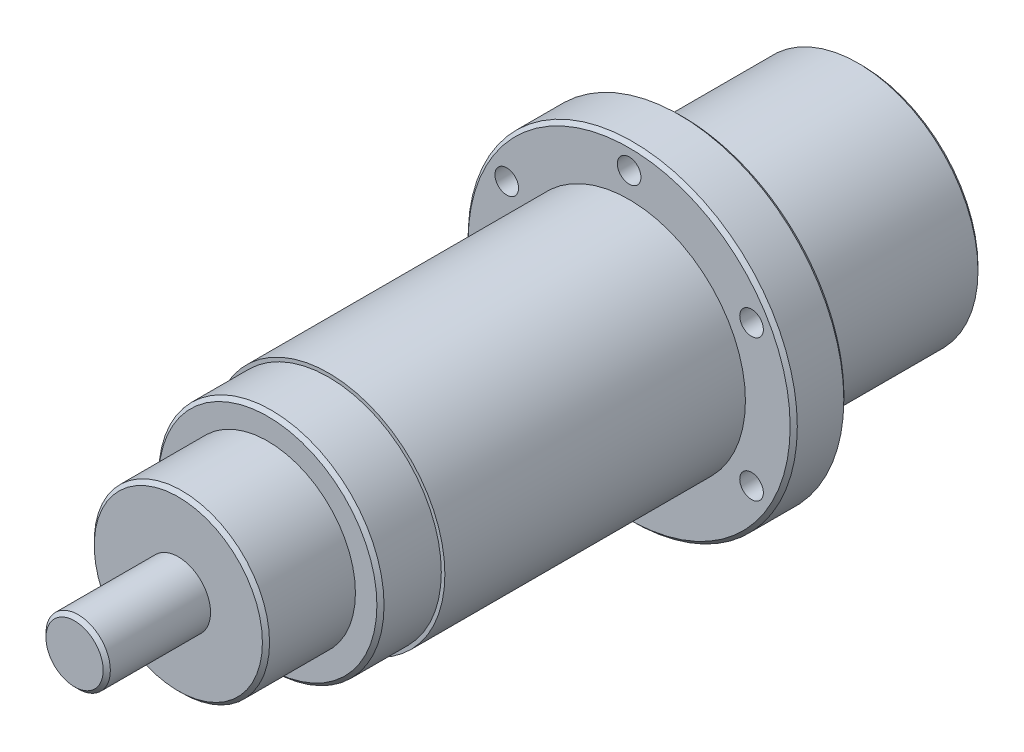
ISO-10303-21;
HEADER;
FILE_DESCRIPTION(('STEP AP214'),'2;1');
FILE_NAME('part.step','',(''),(''),'','','');
FILE_SCHEMA(('AUTOMOTIVE_DESIGN { 1 0 10303 214 1 1 1 1 }'));
ENDSEC;
DATA;
#1=APPLICATION_CONTEXT('core data for automotive mechanical design processes');
#2=APPLICATION_PROTOCOL_DEFINITION('international standard','automotive_design',2000,#1);
#3=PRODUCT_CONTEXT('',#1,'mechanical');
#4=PRODUCT('Part','Part','',(#3));
#5=PRODUCT_RELATED_PRODUCT_CATEGORY('part','',(#4));
#6=PRODUCT_DEFINITION_FORMATION('','',#4);
#7=PRODUCT_DEFINITION_CONTEXT('part definition',#1,'design');
#8=PRODUCT_DEFINITION('design','',#6,#7);
#9=PRODUCT_DEFINITION_SHAPE('','',#8);
#10=(LENGTH_UNIT() NAMED_UNIT(*) SI_UNIT(.MILLI.,.METRE.));
#11=(NAMED_UNIT(*) PLANE_ANGLE_UNIT() SI_UNIT($,.RADIAN.));
#12=(NAMED_UNIT(*) SI_UNIT($,.STERADIAN.) SOLID_ANGLE_UNIT());
#13=UNCERTAINTY_MEASURE_WITH_UNIT(LENGTH_MEASURE(1.E-05),#10,'distance_accuracy_value','');
#14=(GEOMETRIC_REPRESENTATION_CONTEXT(3) GLOBAL_UNCERTAINTY_ASSIGNED_CONTEXT((#13)) GLOBAL_UNIT_ASSIGNED_CONTEXT((#10,
#11,#12)) REPRESENTATION_CONTEXT('',''));
#15=CARTESIAN_POINT('',(0.,0.,0.));
#16=DIRECTION('',(0.,0.,1.));
#17=DIRECTION('',(1.,0.,0.));
#18=AXIS2_PLACEMENT_3D('',#15,#16,#17);
#19=CARTESIAN_POINT('',(0.,0.,50.));
#20=DIRECTION('',(0.,0.,-1.));
#21=DIRECTION('',(-1.,0.,0.));
#22=AXIS2_PLACEMENT_3D('',#19,#20,#21);
#23=CYLINDRICAL_SURFACE('',#22,33.5);
#24=CARTESIAN_POINT('',(0.,0.,1.00000000000002));
#25=DIRECTION('',(0.,0.,1.));
#26=DIRECTION('',(1.,0.,0.));
#27=AXIS2_PLACEMENT_3D('',#24,#25,#26);
#28=CIRCLE('',#27,33.5);
#29=CARTESIAN_POINT('',(33.5,0.,1.00000000000002));
#30=VERTEX_POINT('',#29);
#31=EDGE_CURVE('E47',#30,#30,#28,.T.);
#32=ORIENTED_EDGE('',*,*,#31,.T.);
#33=EDGE_LOOP('',(#32));
#34=FACE_BOUND('',#33,.T.);
#35=CARTESIAN_POINT('',(0.,0.,50.));
#36=DIRECTION('',(0.,0.,1.));
#37=DIRECTION('',(1.,0.,0.));
#38=AXIS2_PLACEMENT_3D('',#35,#36,#37);
#39=CIRCLE('',#38,33.5);
#40=CARTESIAN_POINT('',(33.5,0.,50.));
#41=VERTEX_POINT('',#40);
#42=EDGE_CURVE('E108',#41,#41,#39,.T.);
#43=ORIENTED_EDGE('',*,*,#42,.F.);
#44=EDGE_LOOP('',(#43));
#45=FACE_BOUND('',#44,.T.);
#46=ADVANCED_FACE('F37',(#34,#45),#23,.T.);
#47=CARTESIAN_POINT('',(0.,0.,0.));
#48=DIRECTION('',(0.,0.,1.));
#49=DIRECTION('',(1.,0.,0.));
#50=AXIS2_PLACEMENT_3D('',#47,#48,#49);
#51=PLANE('',#50);
#52=CARTESIAN_POINT('',(0.,0.,0.));
#53=DIRECTION('',(0.,0.,1.));
#54=DIRECTION('',(1.,0.,0.));
#55=AXIS2_PLACEMENT_3D('',#52,#53,#54);
#56=CIRCLE('',#55,32.5);
#57=CARTESIAN_POINT('',(32.5,0.,0.));
#58=VERTEX_POINT('',#57);
#59=EDGE_CURVE('E11',#58,#58,#56,.F.);
#60=ORIENTED_EDGE('',*,*,#59,.T.);
#61=EDGE_LOOP('',(#60));
#62=FACE_BOUND('',#61,.T.);
#63=CARTESIAN_POINT('',(0.,0.,0.));
#64=DIRECTION('',(0.,0.,-1.));
#65=DIRECTION('',(-1.,0.,0.));
#66=AXIS2_PLACEMENT_3D('',#63,#64,#65);
#67=CIRCLE('',#66,15.);
#68=CARTESIAN_POINT('',(-15.,0.,0.));
#69=VERTEX_POINT('',#68);
#70=EDGE_CURVE('E91',#69,#69,#67,.T.);
#71=ORIENTED_EDGE('',*,*,#70,.F.);
#72=EDGE_LOOP('',(#71));
#73=FACE_BOUND('',#72,.T.);
#74=ADVANCED_FACE('F243',(#62,#73),#51,.F.);
#75=CARTESIAN_POINT('',(0.,0.,65.));
#76=DIRECTION('',(0.,0.,-1.));
#77=DIRECTION('',(-1.,0.,0.));
#78=AXIS2_PLACEMENT_3D('',#75,#76,#77);
#79=CYLINDRICAL_SURFACE('',#78,46.);
#80=CARTESIAN_POINT('',(0.,0.,64.));
#81=DIRECTION('',(0.,0.,1.));
#82=DIRECTION('',(1.,0.,0.));
#83=AXIS2_PLACEMENT_3D('',#80,#81,#82);
#84=CIRCLE('',#83,46.);
#85=CARTESIAN_POINT('',(46.,0.,64.));
#86=VERTEX_POINT('',#85);
#87=EDGE_CURVE('E136',#86,#86,#84,.F.);
#88=ORIENTED_EDGE('',*,*,#87,.T.);
#89=EDGE_LOOP('',(#88));
#90=FACE_BOUND('',#89,.T.);
#91=CARTESIAN_POINT('',(0.,0.,51.));
#92=DIRECTION('',(0.,0.,1.));
#93=DIRECTION('',(1.,0.,0.));
#94=AXIS2_PLACEMENT_3D('',#91,#92,#93);
#95=CIRCLE('',#94,46.);
#96=CARTESIAN_POINT('',(46.,0.,51.));
#97=VERTEX_POINT('',#96);
#98=EDGE_CURVE('E133',#97,#97,#95,.T.);
#99=ORIENTED_EDGE('',*,*,#98,.T.);
#100=EDGE_LOOP('',(#99));
#101=FACE_BOUND('',#100,.T.);
#102=ADVANCED_FACE('F249',(#90,#101),#79,.T.);
#103=CARTESIAN_POINT('',(0.,0.,65.));
#104=DIRECTION('',(0.,0.,1.));
#105=DIRECTION('',(1.,0.,0.));
#106=AXIS2_PLACEMENT_3D('',#103,#104,#105);
#107=PLANE('',#106);
#108=CARTESIAN_POINT('',(0.,39.5,65.));
#109=DIRECTION('',(0.,0.,1.));
#110=DIRECTION('',(1.,0.,0.));
#111=AXIS2_PLACEMENT_3D('',#108,#109,#110);
#112=CIRCLE('',#111,3.3);
#113=CARTESIAN_POINT('',(3.3,39.5,65.));
#114=VERTEX_POINT('',#113);
#115=EDGE_CURVE('E42',#114,#114,#112,.T.);
#116=ORIENTED_EDGE('',*,*,#115,.F.);
#117=EDGE_LOOP('',(#116));
#118=FACE_BOUND('',#117,.T.);
#119=CARTESIAN_POINT('',(34.2080034494845,19.7499999999985,65.));
#120=DIRECTION('',(0.,0.,1.));
#121=DIRECTION('',(1.,0.,0.));
#122=AXIS2_PLACEMENT_3D('',#119,#120,#121);
#123=CIRCLE('',#122,3.3000000000017);
#124=CARTESIAN_POINT('',(37.5080034494862,19.7499999999985,65.));
#125=VERTEX_POINT('',#124);
#126=EDGE_CURVE('E157',#125,#125,#123,.T.);
#127=ORIENTED_EDGE('',*,*,#126,.F.);
#128=EDGE_LOOP('',(#127));
#129=FACE_BOUND('',#128,.T.);
#130=CARTESIAN_POINT('',(34.2080034494828,-19.7500000000015,65.));
#131=DIRECTION('',(0.,0.,1.));
#132=DIRECTION('',(1.,0.,0.));
#133=AXIS2_PLACEMENT_3D('',#130,#131,#132);
#134=CIRCLE('',#133,3.30000000000321);
#135=CARTESIAN_POINT('',(37.508003449486,-19.7500000000015,65.));
#136=VERTEX_POINT('',#135);
#137=EDGE_CURVE('E155',#136,#136,#134,.T.);
#138=ORIENTED_EDGE('',*,*,#137,.F.);
#139=EDGE_LOOP('',(#138));
#140=FACE_BOUND('',#139,.T.);
#141=CARTESIAN_POINT('',(-3.35346050293298E-12,-39.5,65.));
#142=DIRECTION('',(0.,0.,1.));
#143=DIRECTION('',(1.,0.,0.));
#144=AXIS2_PLACEMENT_3D('',#141,#142,#143);
#145=CIRCLE('',#144,3.30000000000347);
#146=CARTESIAN_POINT('',(3.30000000000012,-39.5,65.));
#147=VERTEX_POINT('',#146);
#148=EDGE_CURVE('E152',#147,#147,#145,.T.);
#149=ORIENTED_EDGE('',*,*,#148,.F.);
#150=EDGE_LOOP('',(#149));
#151=FACE_BOUND('',#150,.T.);
#152=CARTESIAN_POINT('',(-34.2080034494878,-19.7499999999985,65.));
#153=DIRECTION('',(0.,0.,1.));
#154=DIRECTION('',(1.,0.,0.));
#155=AXIS2_PLACEMENT_3D('',#152,#153,#154);
#156=CIRCLE('',#155,3.30000000000217);
#157=CARTESIAN_POINT('',(-30.9080034494857,-19.7499999999985,65.));
#158=VERTEX_POINT('',#157);
#159=EDGE_CURVE('E148',#158,#158,#156,.T.);
#160=ORIENTED_EDGE('',*,*,#159,.F.);
#161=EDGE_LOOP('',(#160));
#162=FACE_BOUND('',#161,.T.);
#163=CARTESIAN_POINT('',(-34.2080034494862,19.7500000000015,65.));
#164=DIRECTION('',(0.,0.,1.));
#165=DIRECTION('',(1.,0.,0.));
#166=AXIS2_PLACEMENT_3D('',#163,#164,#165);
#167=CIRCLE('',#166,3.30000000000048);
#168=CARTESIAN_POINT('',(-30.9080034494857,19.7500000000015,65.));
#169=VERTEX_POINT('',#168);
#170=EDGE_CURVE('E145',#169,#169,#167,.T.);
#171=ORIENTED_EDGE('',*,*,#170,.F.);
#172=EDGE_LOOP('',(#171));
#173=FACE_BOUND('',#172,.T.);
#174=CARTESIAN_POINT('',(0.,0.,65.));
#175=DIRECTION('',(0.,0.,1.));
#176=DIRECTION('',(1.,0.,0.));
#177=AXIS2_PLACEMENT_3D('',#174,#175,#176);
#178=CIRCLE('',#177,45.);
#179=CARTESIAN_POINT('',(45.,0.,65.));
#180=VERTEX_POINT('',#179);
#181=EDGE_CURVE('E130',#180,#180,#178,.T.);
#182=ORIENTED_EDGE('',*,*,#181,.T.);
#183=EDGE_LOOP('',(#182));
#184=FACE_BOUND('',#183,.T.);
#185=CARTESIAN_POINT('',(0.,0.,65.));
#186=DIRECTION('',(0.,0.,1.));
#187=DIRECTION('',(1.,0.,0.));
#188=AXIS2_PLACEMENT_3D('',#185,#186,#187);
#189=CIRCLE('',#188,32.5);
#190=CARTESIAN_POINT('',(32.5,0.,65.));
#191=VERTEX_POINT('',#190);
#192=EDGE_CURVE('E105',#191,#191,#189,.T.);
#193=ORIENTED_EDGE('',*,*,#192,.F.);
#194=EDGE_LOOP('',(#193));
#195=FACE_BOUND('',#194,.T.);
#196=ADVANCED_FACE('F348',(#118,#129,#140,#151,#162,#173,#184,#195),#107,.T.);
#197=CARTESIAN_POINT('',(0.,0.,50.));
#198=DIRECTION('',(0.,0.,1.));
#199=DIRECTION('',(1.,0.,0.));
#200=AXIS2_PLACEMENT_3D('',#197,#198,#199);
#201=PLANE('',#200);
#202=CARTESIAN_POINT('',(0.,0.,50.));
#203=DIRECTION('',(0.,0.,1.));
#204=DIRECTION('',(1.,0.,0.));
#205=AXIS2_PLACEMENT_3D('',#202,#203,#204);
#206=CIRCLE('',#205,45.);
#207=CARTESIAN_POINT('',(-38.9711431702992,22.5000000000008,50.));
#208=VERTEX_POINT('',#207);
#209=CARTESIAN_POINT('',(0.,45.,50.));
#210=VERTEX_POINT('',#209);
#211=EDGE_CURVE('E197',#208,#210,#206,.F.);
#212=ORIENTED_EDGE('',*,*,#211,.T.);
#213=CARTESIAN_POINT('',(0.,39.5,50.));
#214=DIRECTION('',(0.,0.,-1.));
#215=DIRECTION('',(-1.,0.,0.));
#216=AXIS2_PLACEMENT_3D('',#213,#214,#215);
#217=CIRCLE('',#216,5.5);
#218=EDGE_CURVE('E58',#210,#210,#217,.T.);
#219=ORIENTED_EDGE('',*,*,#218,.F.);
#220=CARTESIAN_POINT('',(38.9711431703002,22.4999999999991,50.));
#221=VERTEX_POINT('',#220);
#222=EDGE_CURVE('E199',#210,#221,#206,.F.);
#223=ORIENTED_EDGE('',*,*,#222,.T.);
#224=CARTESIAN_POINT('',(34.2080034494845,19.7499999999985,50.));
#225=DIRECTION('',(0.,0.,-1.));
#226=DIRECTION('',(-1.,0.,0.));
#227=AXIS2_PLACEMENT_3D('',#224,#225,#226);
#228=CIRCLE('',#227,5.50000000000169);
#229=EDGE_CURVE('E53',#221,#221,#228,.T.);
#230=ORIENTED_EDGE('',*,*,#229,.F.);
#231=CARTESIAN_POINT('',(38.9711431702983,-22.5000000000025,50.));
#232=VERTEX_POINT('',#231);
#233=EDGE_CURVE('E139',#221,#232,#206,.F.);
#234=ORIENTED_EDGE('',*,*,#233,.T.);
#235=CARTESIAN_POINT('',(34.2080034494828,-19.7500000000015,50.));
#236=DIRECTION('',(0.,0.,-1.));
#237=DIRECTION('',(-1.,0.,0.));
#238=AXIS2_PLACEMENT_3D('',#235,#236,#237);
#239=CIRCLE('',#238,5.50000000000321);
#240=EDGE_CURVE('E72',#232,#232,#239,.T.);
#241=ORIENTED_EDGE('',*,*,#240,.F.);
#242=CARTESIAN_POINT('',(-3.82039804131605E-12,-45.,50.));
#243=VERTEX_POINT('',#242);
#244=EDGE_CURVE('E140',#232,#243,#206,.F.);
#245=ORIENTED_EDGE('',*,*,#244,.T.);
#246=CARTESIAN_POINT('',(-3.35346050293298E-12,-39.5,50.));
#247=DIRECTION('',(0.,0.,-1.));
#248=DIRECTION('',(-1.,0.,0.));
#249=AXIS2_PLACEMENT_3D('',#246,#247,#248);
#250=CIRCLE('',#249,5.50000000000347);
#251=EDGE_CURVE('E81',#243,#243,#250,.T.);
#252=ORIENTED_EDGE('',*,*,#251,.F.);
#253=CARTESIAN_POINT('',(-38.9711431703011,-22.4999999999975,50.));
#254=VERTEX_POINT('',#253);
#255=EDGE_CURVE('E142',#243,#254,#206,.F.);
#256=ORIENTED_EDGE('',*,*,#255,.T.);
#257=CARTESIAN_POINT('',(-34.2080034494878,-19.7499999999985,50.));
#258=DIRECTION('',(0.,0.,-1.));
#259=DIRECTION('',(-1.,0.,0.));
#260=AXIS2_PLACEMENT_3D('',#257,#258,#259);
#261=CIRCLE('',#260,5.50000000000217);
#262=EDGE_CURVE('E175',#254,#254,#261,.T.);
#263=ORIENTED_EDGE('',*,*,#262,.F.);
#264=EDGE_CURVE('E196',#254,#208,#206,.F.);
#265=ORIENTED_EDGE('',*,*,#264,.T.);
#266=CARTESIAN_POINT('',(-34.2080034494862,19.7500000000015,50.));
#267=DIRECTION('',(0.,0.,-1.));
#268=DIRECTION('',(-1.,0.,0.));
#269=AXIS2_PLACEMENT_3D('',#266,#267,#268);
#270=CIRCLE('',#269,5.50000000000048);
#271=EDGE_CURVE('E170',#208,#208,#270,.T.);
#272=ORIENTED_EDGE('',*,*,#271,.F.);
#273=EDGE_LOOP('',(#212,#219,#223,#230,#234,#241,#245,#252,#256,#263,#265,#272));
#274=FACE_BOUND('',#273,.T.);
#275=ORIENTED_EDGE('',*,*,#42,.T.);
#276=EDGE_LOOP('',(#275));
#277=FACE_BOUND('',#276,.T.);
#278=ADVANCED_FACE('F185',(#274,#277),#201,.F.);
#279=CARTESIAN_POINT('',(0.,0.,149.));
#280=DIRECTION('',(0.,0.,-1.));
#281=DIRECTION('',(-1.,0.,0.));
#282=AXIS2_PLACEMENT_3D('',#279,#280,#281);
#283=CYLINDRICAL_SURFACE('',#282,32.5);
#284=CARTESIAN_POINT('',(0.,0.,149.));
#285=DIRECTION('',(0.,0.,1.));
#286=DIRECTION('',(1.,0.,0.));
#287=AXIS2_PLACEMENT_3D('',#284,#285,#286);
#288=CIRCLE('',#287,32.5);
#289=CARTESIAN_POINT('',(32.5,0.,149.));
#290=VERTEX_POINT('',#289);
#291=EDGE_CURVE('E90',#290,#290,#288,.T.);
#292=ORIENTED_EDGE('',*,*,#291,.F.);
#293=EDGE_LOOP('',(#292));
#294=FACE_BOUND('',#293,.T.);
#295=ORIENTED_EDGE('',*,*,#192,.T.);
#296=EDGE_LOOP('',(#295));
#297=FACE_BOUND('',#296,.T.);
#298=ADVANCED_FACE('F343',(#294,#297),#283,.T.);
#299=CARTESIAN_POINT('',(0.,0.,149.));
#300=DIRECTION('',(0.,0.,1.));
#301=DIRECTION('',(1.,0.,0.));
#302=AXIS2_PLACEMENT_3D('',#299,#300,#301);
#303=PLANE('',#302);
#304=CARTESIAN_POINT('',(0.,0.,149.));
#305=DIRECTION('',(0.,0.,1.));
#306=DIRECTION('',(1.,0.,0.));
#307=AXIS2_PLACEMENT_3D('',#304,#305,#306);
#308=CIRCLE('',#307,31.5);
#309=CARTESIAN_POINT('',(31.5,0.,149.));
#310=VERTEX_POINT('',#309);
#311=EDGE_CURVE('E102',#310,#310,#308,.T.);
#312=ORIENTED_EDGE('',*,*,#311,.F.);
#313=EDGE_LOOP('',(#312));
#314=FACE_BOUND('',#313,.T.);
#315=ORIENTED_EDGE('',*,*,#291,.T.);
#316=EDGE_LOOP('',(#315));
#317=FACE_BOUND('',#316,.T.);
#318=ADVANCED_FACE('F339',(#314,#317),#303,.T.);
#319=CARTESIAN_POINT('',(0.,0.,166.));
#320=DIRECTION('',(0.,0.,-1.));
#321=DIRECTION('',(-1.,0.,0.));
#322=AXIS2_PLACEMENT_3D('',#319,#320,#321);
#323=CYLINDRICAL_SURFACE('',#322,31.5);
#324=CARTESIAN_POINT('',(0.,0.,165.));
#325=DIRECTION('',(0.,0.,1.));
#326=DIRECTION('',(1.,0.,0.));
#327=AXIS2_PLACEMENT_3D('',#324,#325,#326);
#328=CIRCLE('',#327,31.5);
#329=CARTESIAN_POINT('',(31.5,0.,165.));
#330=VERTEX_POINT('',#329);
#331=EDGE_CURVE('E127',#330,#330,#328,.F.);
#332=ORIENTED_EDGE('',*,*,#331,.T.);
#333=EDGE_LOOP('',(#332));
#334=FACE_BOUND('',#333,.T.);
#335=ORIENTED_EDGE('',*,*,#311,.T.);
#336=EDGE_LOOP('',(#335));
#337=FACE_BOUND('',#336,.T.);
#338=ADVANCED_FACE('F335',(#334,#337),#323,.T.);
#339=CARTESIAN_POINT('',(0.,0.,166.));
#340=DIRECTION('',(0.,0.,1.));
#341=DIRECTION('',(1.,0.,0.));
#342=AXIS2_PLACEMENT_3D('',#339,#340,#341);
#343=PLANE('',#342);
#344=CARTESIAN_POINT('',(0.,0.,166.));
#345=DIRECTION('',(0.,0.,1.));
#346=DIRECTION('',(1.,0.,0.));
#347=AXIS2_PLACEMENT_3D('',#344,#345,#346);
#348=CIRCLE('',#347,30.5);
#349=CARTESIAN_POINT('',(30.5,0.,166.));
#350=VERTEX_POINT('',#349);
#351=EDGE_CURVE('E124',#350,#350,#348,.T.);
#352=ORIENTED_EDGE('',*,*,#351,.T.);
#353=EDGE_LOOP('',(#352));
#354=FACE_BOUND('',#353,.T.);
#355=CARTESIAN_POINT('',(0.,0.,166.));
#356=DIRECTION('',(0.,0.,1.));
#357=DIRECTION('',(1.,0.,0.));
#358=AXIS2_PLACEMENT_3D('',#355,#356,#357);
#359=CIRCLE('',#358,24.5);
#360=CARTESIAN_POINT('',(24.5,0.,166.));
#361=VERTEX_POINT('',#360);
#362=EDGE_CURVE('E99',#361,#361,#359,.T.);
#363=ORIENTED_EDGE('',*,*,#362,.F.);
#364=EDGE_LOOP('',(#363));
#365=FACE_BOUND('',#364,.T.);
#366=ADVANCED_FACE('F331',(#354,#365),#343,.T.);
#367=CARTESIAN_POINT('',(0.,0.,191.));
#368=DIRECTION('',(0.,0.,-1.));
#369=DIRECTION('',(-1.,0.,0.));
#370=AXIS2_PLACEMENT_3D('',#367,#368,#369);
#371=CYLINDRICAL_SURFACE('',#370,24.5);
#372=CARTESIAN_POINT('',(0.,0.,190.));
#373=DIRECTION('',(0.,0.,1.));
#374=DIRECTION('',(1.,0.,0.));
#375=AXIS2_PLACEMENT_3D('',#372,#373,#374);
#376=CIRCLE('',#375,24.5);
#377=CARTESIAN_POINT('',(24.5,0.,190.));
#378=VERTEX_POINT('',#377);
#379=EDGE_CURVE('E121',#378,#378,#376,.F.);
#380=ORIENTED_EDGE('',*,*,#379,.T.);
#381=EDGE_LOOP('',(#380));
#382=FACE_BOUND('',#381,.T.);
#383=ORIENTED_EDGE('',*,*,#362,.T.);
#384=EDGE_LOOP('',(#383));
#385=FACE_BOUND('',#384,.T.);
#386=ADVANCED_FACE('F327',(#382,#385),#371,.T.);
#387=CARTESIAN_POINT('',(0.,0.,191.));
#388=DIRECTION('',(0.,0.,1.));
#389=DIRECTION('',(1.,0.,0.));
#390=AXIS2_PLACEMENT_3D('',#387,#388,#389);
#391=PLANE('',#390);
#392=CARTESIAN_POINT('',(0.,0.,191.));
#393=DIRECTION('',(0.,0.,1.));
#394=DIRECTION('',(1.,0.,0.));
#395=AXIS2_PLACEMENT_3D('',#392,#393,#394);
#396=CIRCLE('',#395,23.5);
#397=CARTESIAN_POINT('',(23.5,0.,191.));
#398=VERTEX_POINT('',#397);
#399=EDGE_CURVE('E118',#398,#398,#396,.T.);
#400=ORIENTED_EDGE('',*,*,#399,.T.);
#401=EDGE_LOOP('',(#400));
#402=FACE_BOUND('',#401,.T.);
#403=CARTESIAN_POINT('',(0.,0.,191.));
#404=DIRECTION('',(0.,0.,1.));
#405=DIRECTION('',(1.,0.,0.));
#406=AXIS2_PLACEMENT_3D('',#403,#404,#405);
#407=CIRCLE('',#406,9.);
#408=CARTESIAN_POINT('',(9.,0.,191.));
#409=VERTEX_POINT('',#408);
#410=EDGE_CURVE('E95',#409,#409,#407,.T.);
#411=ORIENTED_EDGE('',*,*,#410,.F.);
#412=EDGE_LOOP('',(#411));
#413=FACE_BOUND('',#412,.T.);
#414=ADVANCED_FACE('F323',(#402,#413),#391,.T.);
#415=CARTESIAN_POINT('',(0.,0.,220.));
#416=DIRECTION('',(0.,0.,-1.));
#417=DIRECTION('',(-1.,0.,0.));
#418=AXIS2_PLACEMENT_3D('',#415,#416,#417);
#419=CYLINDRICAL_SURFACE('',#418,9.);
#420=CARTESIAN_POINT('',(0.,0.,219.));
#421=DIRECTION('',(0.,0.,1.));
#422=DIRECTION('',(1.,0.,0.));
#423=AXIS2_PLACEMENT_3D('',#420,#421,#422);
#424=CIRCLE('',#423,9.);
#425=CARTESIAN_POINT('',(9.,0.,219.));
#426=VERTEX_POINT('',#425);
#427=EDGE_CURVE('E115',#426,#426,#424,.F.);
#428=ORIENTED_EDGE('',*,*,#427,.T.);
#429=EDGE_LOOP('',(#428));
#430=FACE_BOUND('',#429,.T.);
#431=ORIENTED_EDGE('',*,*,#410,.T.);
#432=EDGE_LOOP('',(#431));
#433=FACE_BOUND('',#432,.T.);
#434=ADVANCED_FACE('F315',(#430,#433),#419,.T.);
#435=CARTESIAN_POINT('',(0.,0.,220.));
#436=DIRECTION('',(0.,0.,1.));
#437=DIRECTION('',(1.,0.,0.));
#438=AXIS2_PLACEMENT_3D('',#435,#436,#437);
#439=PLANE('',#438);
#440=CARTESIAN_POINT('',(0.,0.,220.));
#441=DIRECTION('',(0.,0.,1.));
#442=DIRECTION('',(1.,0.,0.));
#443=AXIS2_PLACEMENT_3D('',#440,#441,#442);
#444=CIRCLE('',#443,8.00000000000014);
#445=CARTESIAN_POINT('',(8.00000000000014,0.,220.));
#446=VERTEX_POINT('',#445);
#447=EDGE_CURVE('E98',#446,#446,#444,.T.);
#448=ORIENTED_EDGE('',*,*,#447,.T.);
#449=EDGE_LOOP('',(#448));
#450=FACE_BOUND('',#449,.T.);
#451=ADVANCED_FACE('F306',(#450),#439,.T.);
#452=CARTESIAN_POINT('',(0.,0.,20.));
#453=DIRECTION('',(0.,0.,-1.));
#454=DIRECTION('',(-1.,0.,0.));
#455=AXIS2_PLACEMENT_3D('',#452,#453,#454);
#456=CYLINDRICAL_SURFACE('',#455,15.);
#457=CARTESIAN_POINT('',(0.,0.,20.));
#458=DIRECTION('',(0.,0.,-1.));
#459=DIRECTION('',(-1.,0.,0.));
#460=AXIS2_PLACEMENT_3D('',#457,#458,#459);
#461=CIRCLE('',#460,15.);
#462=CARTESIAN_POINT('',(-15.,0.,20.));
#463=VERTEX_POINT('',#462);
#464=EDGE_CURVE('E87',#463,#463,#461,.T.);
#465=ORIENTED_EDGE('',*,*,#464,.F.);
#466=EDGE_LOOP('',(#465));
#467=FACE_BOUND('',#466,.T.);
#468=ORIENTED_EDGE('',*,*,#70,.T.);
#469=EDGE_LOOP('',(#468));
#470=FACE_BOUND('',#469,.T.);
#471=ADVANCED_FACE('F304',(#467,#470),#456,.F.);
#472=CARTESIAN_POINT('',(0.,0.,20.));
#473=DIRECTION('',(0.,0.,-1.));
#474=DIRECTION('',(-1.,0.,0.));
#475=AXIS2_PLACEMENT_3D('',#472,#473,#474);
#476=PLANE('',#475);
#477=ORIENTED_EDGE('',*,*,#464,.T.);
#478=EDGE_LOOP('',(#477));
#479=FACE_BOUND('',#478,.T.);
#480=ADVANCED_FACE('F263',(#479),#476,.T.);
#481=CARTESIAN_POINT('',(0.,0.,220.));
#482=DIRECTION('',(0.,0.,-1.));
#483=DIRECTION('',(-1.,0.,0.));
#484=AXIS2_PLACEMENT_3D('',#481,#482,#483);
#485=CONICAL_SURFACE('',#484,8.00000000000014,0.785398163397445);
#486=ORIENTED_EDGE('',*,*,#427,.F.);
#487=EDGE_LOOP('',(#486));
#488=FACE_BOUND('',#487,.T.);
#489=ORIENTED_EDGE('',*,*,#447,.F.);
#490=EDGE_LOOP('',(#489));
#491=FACE_BOUND('',#490,.T.);
#492=ADVANCED_FACE('F256',(#488,#491),#485,.T.);
#493=CARTESIAN_POINT('',(0.,0.,191.));
#494=DIRECTION('',(0.,0.,-1.));
#495=DIRECTION('',(-1.,0.,0.));
#496=AXIS2_PLACEMENT_3D('',#493,#494,#495);
#497=CONICAL_SURFACE('',#496,23.5,0.785398163397438);
#498=ORIENTED_EDGE('',*,*,#379,.F.);
#499=EDGE_LOOP('',(#498));
#500=FACE_BOUND('',#499,.T.);
#501=ORIENTED_EDGE('',*,*,#399,.F.);
#502=EDGE_LOOP('',(#501));
#503=FACE_BOUND('',#502,.T.);
#504=ADVANCED_FACE('F262',(#500,#503),#497,.T.);
#505=CARTESIAN_POINT('',(0.,0.,166.));
#506=DIRECTION('',(0.,0.,-1.));
#507=DIRECTION('',(-1.,0.,0.));
#508=AXIS2_PLACEMENT_3D('',#505,#506,#507);
#509=CONICAL_SURFACE('',#508,30.5,0.785398163397435);
#510=ORIENTED_EDGE('',*,*,#331,.F.);
#511=EDGE_LOOP('',(#510));
#512=FACE_BOUND('',#511,.T.);
#513=ORIENTED_EDGE('',*,*,#351,.F.);
#514=EDGE_LOOP('',(#513));
#515=FACE_BOUND('',#514,.T.);
#516=ADVANCED_FACE('F270',(#512,#515),#509,.T.);
#517=CARTESIAN_POINT('',(0.,0.,65.));
#518=DIRECTION('',(0.,0.,-1.));
#519=DIRECTION('',(-1.,0.,0.));
#520=AXIS2_PLACEMENT_3D('',#517,#518,#519);
#521=CONICAL_SURFACE('',#520,45.,0.785398163397445);
#522=ORIENTED_EDGE('',*,*,#87,.F.);
#523=EDGE_LOOP('',(#522));
#524=FACE_BOUND('',#523,.T.);
#525=ORIENTED_EDGE('',*,*,#181,.F.);
#526=EDGE_LOOP('',(#525));
#527=FACE_BOUND('',#526,.T.);
#528=ADVANCED_FACE('F277',(#524,#527),#521,.T.);
#529=CARTESIAN_POINT('',(0.,0.,51.));
#530=DIRECTION('',(0.,0.,1.));
#531=DIRECTION('',(1.,0.,0.));
#532=AXIS2_PLACEMENT_3D('',#529,#530,#531);
#533=CONICAL_SURFACE('',#532,46.,0.785398163397452);
#534=ORIENTED_EDGE('',*,*,#244,.F.);
#535=ORIENTED_EDGE('',*,*,#233,.F.);
#536=ORIENTED_EDGE('',*,*,#222,.F.);
#537=ORIENTED_EDGE('',*,*,#211,.F.);
#538=ORIENTED_EDGE('',*,*,#264,.F.);
#539=ORIENTED_EDGE('',*,*,#255,.F.);
#540=EDGE_LOOP('',(#534,#535,#536,#537,#538,#539));
#541=FACE_BOUND('',#540,.T.);
#542=ORIENTED_EDGE('',*,*,#98,.F.);
#543=EDGE_LOOP('',(#542));
#544=FACE_BOUND('',#543,.T.);
#545=ADVANCED_FACE('F191',(#541,#544),#533,.T.);
#546=CARTESIAN_POINT('',(0.,0.,1.00000000000002));
#547=DIRECTION('',(0.,0.,1.));
#548=DIRECTION('',(1.,0.,0.));
#549=AXIS2_PLACEMENT_3D('',#546,#547,#548);
#550=CONICAL_SURFACE('',#549,33.5,0.785398163397438);
#551=ORIENTED_EDGE('',*,*,#59,.F.);
#552=EDGE_LOOP('',(#551));
#553=FACE_BOUND('',#552,.T.);
#554=ORIENTED_EDGE('',*,*,#31,.F.);
#555=EDGE_LOOP('',(#554));
#556=FACE_BOUND('',#555,.T.);
#557=ADVANCED_FACE('F40',(#553,#556),#550,.T.);
#558=CARTESIAN_POINT('',(-34.2080034494862,19.7500000000015,57.));
#559=DIRECTION('',(0.,0.,-1.));
#560=DIRECTION('',(-1.,0.,0.));
#561=AXIS2_PLACEMENT_3D('',#558,#559,#560);
#562=CYLINDRICAL_SURFACE('',#561,5.50000000000048);
#563=CARTESIAN_POINT('',(-34.2080034494862,19.7500000000015,57.));
#564=DIRECTION('',(0.,0.,-1.));
#565=DIRECTION('',(-1.,0.,0.));
#566=AXIS2_PLACEMENT_3D('',#563,#564,#565);
#567=CIRCLE('',#566,5.50000000000048);
#568=CARTESIAN_POINT('',(-39.7080034494866,19.7500000000015,57.));
#569=VERTEX_POINT('',#568);
#570=EDGE_CURVE('E167',#569,#569,#567,.T.);
#571=ORIENTED_EDGE('',*,*,#570,.F.);
#572=EDGE_LOOP('',(#571));
#573=FACE_BOUND('',#572,.T.);
#574=ORIENTED_EDGE('',*,*,#271,.T.);
#575=EDGE_LOOP('',(#574));
#576=FACE_BOUND('',#575,.T.);
#577=ADVANCED_FACE('F290',(#573,#576),#562,.F.);
#578=CARTESIAN_POINT('',(-34.2080034494862,19.7500000000015,57.));
#579=DIRECTION('',(0.,0.,-1.));
#580=DIRECTION('',(-1.,0.,0.));
#581=AXIS2_PLACEMENT_3D('',#578,#579,#580);
#582=PLANE('',#581);
#583=CARTESIAN_POINT('',(-34.2080034494862,19.7500000000015,57.));
#584=DIRECTION('',(0.,0.,-1.));
#585=DIRECTION('',(-1.,0.,0.));
#586=AXIS2_PLACEMENT_3D('',#583,#584,#585);
#587=CIRCLE('',#586,3.30000000000048);
#588=CARTESIAN_POINT('',(-37.5080034494866,19.7500000000015,57.));
#589=VERTEX_POINT('',#588);
#590=EDGE_CURVE('E215',#589,#589,#587,.T.);
#591=ORIENTED_EDGE('',*,*,#590,.F.);
#592=EDGE_LOOP('',(#591));
#593=FACE_BOUND('',#592,.T.);
#594=ORIENTED_EDGE('',*,*,#570,.T.);
#595=EDGE_LOOP('',(#594));
#596=FACE_BOUND('',#595,.T.);
#597=ADVANCED_FACE('F295',(#593,#596),#582,.T.);
#598=CARTESIAN_POINT('',(-34.2080034494878,-19.7499999999985,57.));
#599=DIRECTION('',(0.,0.,-1.));
#600=DIRECTION('',(-1.,0.,0.));
#601=AXIS2_PLACEMENT_3D('',#598,#599,#600);
#602=CYLINDRICAL_SURFACE('',#601,5.50000000000217);
#603=CARTESIAN_POINT('',(-34.2080034494878,-19.7499999999985,57.));
#604=DIRECTION('',(0.,0.,-1.));
#605=DIRECTION('',(-1.,0.,0.));
#606=AXIS2_PLACEMENT_3D('',#603,#604,#605);
#607=CIRCLE('',#606,5.50000000000217);
#608=CARTESIAN_POINT('',(-39.70800344949,-19.7499999999985,57.));
#609=VERTEX_POINT('',#608);
#610=EDGE_CURVE('E172',#609,#609,#607,.T.);
#611=ORIENTED_EDGE('',*,*,#610,.F.);
#612=EDGE_LOOP('',(#611));
#613=FACE_BOUND('',#612,.T.);
#614=ORIENTED_EDGE('',*,*,#262,.T.);
#615=EDGE_LOOP('',(#614));
#616=FACE_BOUND('',#615,.T.);
#617=ADVANCED_FACE('F457',(#613,#616),#602,.F.);
#618=CARTESIAN_POINT('',(-34.2080034494878,-19.7499999999985,57.));
#619=DIRECTION('',(0.,0.,-1.));
#620=DIRECTION('',(-1.,0.,0.));
#621=AXIS2_PLACEMENT_3D('',#618,#619,#620);
#622=PLANE('',#621);
#623=CARTESIAN_POINT('',(-34.2080034494878,-19.7499999999985,57.));
#624=DIRECTION('',(0.,0.,-1.));
#625=DIRECTION('',(-1.,0.,0.));
#626=AXIS2_PLACEMENT_3D('',#623,#624,#625);
#627=CIRCLE('',#626,3.30000000000217);
#628=CARTESIAN_POINT('',(-37.50800344949,-19.7499999999985,57.));
#629=VERTEX_POINT('',#628);
#630=EDGE_CURVE('E212',#629,#629,#627,.T.);
#631=ORIENTED_EDGE('',*,*,#630,.F.);
#632=EDGE_LOOP('',(#631));
#633=FACE_BOUND('',#632,.T.);
#634=ORIENTED_EDGE('',*,*,#610,.T.);
#635=EDGE_LOOP('',(#634));
#636=FACE_BOUND('',#635,.T.);
#637=ADVANCED_FACE('F466',(#633,#636),#622,.T.);
#638=CARTESIAN_POINT('',(-3.35346050293298E-12,-39.5,57.));
#639=DIRECTION('',(0.,0.,-1.));
#640=DIRECTION('',(-1.,0.,0.));
#641=AXIS2_PLACEMENT_3D('',#638,#639,#640);
#642=CYLINDRICAL_SURFACE('',#641,5.50000000000347);
#643=CARTESIAN_POINT('',(-3.35346050293298E-12,-39.5,57.));
#644=DIRECTION('',(0.,0.,-1.));
#645=DIRECTION('',(-1.,0.,0.));
#646=AXIS2_PLACEMENT_3D('',#643,#644,#645);
#647=CIRCLE('',#646,5.50000000000347);
#648=CARTESIAN_POINT('',(-5.50000000000682,-39.5,57.));
#649=VERTEX_POINT('',#648);
#650=EDGE_CURVE('E177',#649,#649,#647,.T.);
#651=ORIENTED_EDGE('',*,*,#650,.F.);
#652=EDGE_LOOP('',(#651));
#653=FACE_BOUND('',#652,.T.);
#654=ORIENTED_EDGE('',*,*,#251,.T.);
#655=EDGE_LOOP('',(#654));
#656=FACE_BOUND('',#655,.T.);
#657=ADVANCED_FACE('F181',(#653,#656),#642,.F.);
#658=CARTESIAN_POINT('',(-3.35346050293298E-12,-39.5,57.));
#659=DIRECTION('',(0.,0.,-1.));
#660=DIRECTION('',(-1.,0.,0.));
#661=AXIS2_PLACEMENT_3D('',#658,#659,#660);
#662=PLANE('',#661);
#663=CARTESIAN_POINT('',(-3.35346050293298E-12,-39.5,57.));
#664=DIRECTION('',(0.,0.,-1.));
#665=DIRECTION('',(-1.,0.,0.));
#666=AXIS2_PLACEMENT_3D('',#663,#664,#665);
#667=CIRCLE('',#666,3.30000000000347);
#668=CARTESIAN_POINT('',(-3.30000000000682,-39.5,57.));
#669=VERTEX_POINT('',#668);
#670=EDGE_CURVE('E208',#669,#669,#667,.T.);
#671=ORIENTED_EDGE('',*,*,#670,.F.);
#672=EDGE_LOOP('',(#671));
#673=FACE_BOUND('',#672,.T.);
#674=ORIENTED_EDGE('',*,*,#650,.T.);
#675=EDGE_LOOP('',(#674));
#676=FACE_BOUND('',#675,.T.);
#677=ADVANCED_FACE('F483',(#673,#676),#662,.T.);
#678=CARTESIAN_POINT('',(34.2080034494828,-19.7500000000015,57.));
#679=DIRECTION('',(0.,0.,-1.));
#680=DIRECTION('',(-1.,0.,0.));
#681=AXIS2_PLACEMENT_3D('',#678,#679,#680);
#682=CYLINDRICAL_SURFACE('',#681,5.50000000000321);
#683=CARTESIAN_POINT('',(34.2080034494828,-19.7500000000015,57.));
#684=DIRECTION('',(0.,0.,-1.));
#685=DIRECTION('',(-1.,0.,0.));
#686=AXIS2_PLACEMENT_3D('',#683,#684,#685);
#687=CIRCLE('',#686,5.50000000000321);
#688=CARTESIAN_POINT('',(28.7080034494796,-19.7500000000015,57.));
#689=VERTEX_POINT('',#688);
#690=EDGE_CURVE('E77',#689,#689,#687,.T.);
#691=ORIENTED_EDGE('',*,*,#690,.F.);
#692=EDGE_LOOP('',(#691));
#693=FACE_BOUND('',#692,.T.);
#694=ORIENTED_EDGE('',*,*,#240,.T.);
#695=EDGE_LOOP('',(#694));
#696=FACE_BOUND('',#695,.T.);
#697=ADVANCED_FACE('F73',(#693,#696),#682,.F.);
#698=CARTESIAN_POINT('',(34.2080034494828,-19.7500000000015,57.));
#699=DIRECTION('',(0.,0.,-1.));
#700=DIRECTION('',(-1.,0.,0.));
#701=AXIS2_PLACEMENT_3D('',#698,#699,#700);
#702=PLANE('',#701);
#703=CARTESIAN_POINT('',(34.2080034494828,-19.7500000000015,57.));
#704=DIRECTION('',(0.,0.,-1.));
#705=DIRECTION('',(-1.,0.,0.));
#706=AXIS2_PLACEMENT_3D('',#703,#704,#705);
#707=CIRCLE('',#706,3.30000000000321);
#708=CARTESIAN_POINT('',(30.9080034494796,-19.7500000000015,57.));
#709=VERTEX_POINT('',#708);
#710=EDGE_CURVE('E205',#709,#709,#707,.T.);
#711=ORIENTED_EDGE('',*,*,#710,.F.);
#712=EDGE_LOOP('',(#711));
#713=FACE_BOUND('',#712,.T.);
#714=ORIENTED_EDGE('',*,*,#690,.T.);
#715=EDGE_LOOP('',(#714));
#716=FACE_BOUND('',#715,.T.);
#717=ADVANCED_FACE('F500',(#713,#716),#702,.T.);
#718=CARTESIAN_POINT('',(34.2080034494845,19.7499999999985,57.));
#719=DIRECTION('',(0.,0.,-1.));
#720=DIRECTION('',(-1.,0.,0.));
#721=AXIS2_PLACEMENT_3D('',#718,#719,#720);
#722=CYLINDRICAL_SURFACE('',#721,5.50000000000169);
#723=CARTESIAN_POINT('',(34.2080034494845,19.7499999999985,57.));
#724=DIRECTION('',(0.,0.,-1.));
#725=DIRECTION('',(-1.,0.,0.));
#726=AXIS2_PLACEMENT_3D('',#723,#724,#725);
#727=CIRCLE('',#726,5.50000000000169);
#728=CARTESIAN_POINT('',(28.7080034494828,19.7499999999985,57.));
#729=VERTEX_POINT('',#728);
#730=EDGE_CURVE('E78',#729,#729,#727,.T.);
#731=ORIENTED_EDGE('',*,*,#730,.F.);
#732=EDGE_LOOP('',(#731));
#733=FACE_BOUND('',#732,.T.);
#734=ORIENTED_EDGE('',*,*,#229,.T.);
#735=EDGE_LOOP('',(#734));
#736=FACE_BOUND('',#735,.T.);
#737=ADVANCED_FACE('F239',(#733,#736),#722,.F.);
#738=CARTESIAN_POINT('',(34.2080034494845,19.7499999999985,57.));
#739=DIRECTION('',(0.,0.,-1.));
#740=DIRECTION('',(-1.,0.,0.));
#741=AXIS2_PLACEMENT_3D('',#738,#739,#740);
#742=PLANE('',#741);
#743=CARTESIAN_POINT('',(34.2080034494845,19.7499999999985,57.));
#744=DIRECTION('',(0.,0.,-1.));
#745=DIRECTION('',(-1.,0.,0.));
#746=AXIS2_PLACEMENT_3D('',#743,#744,#745);
#747=CIRCLE('',#746,3.3000000000017);
#748=CARTESIAN_POINT('',(30.9080034494828,19.7499999999985,57.));
#749=VERTEX_POINT('',#748);
#750=EDGE_CURVE('E209',#749,#749,#747,.T.);
#751=ORIENTED_EDGE('',*,*,#750,.F.);
#752=EDGE_LOOP('',(#751));
#753=FACE_BOUND('',#752,.T.);
#754=ORIENTED_EDGE('',*,*,#730,.T.);
#755=EDGE_LOOP('',(#754));
#756=FACE_BOUND('',#755,.T.);
#757=ADVANCED_FACE('F234',(#753,#756),#742,.T.);
#758=CARTESIAN_POINT('',(0.,39.5,57.));
#759=DIRECTION('',(0.,0.,-1.));
#760=DIRECTION('',(-1.,0.,0.));
#761=AXIS2_PLACEMENT_3D('',#758,#759,#760);
#762=CYLINDRICAL_SURFACE('',#761,5.5);
#763=CARTESIAN_POINT('',(0.,39.5,57.));
#764=DIRECTION('',(0.,0.,-1.));
#765=DIRECTION('',(-1.,0.,0.));
#766=AXIS2_PLACEMENT_3D('',#763,#764,#765);
#767=CIRCLE('',#766,5.5);
#768=CARTESIAN_POINT('',(-5.5,39.5,57.));
#769=VERTEX_POINT('',#768);
#770=EDGE_CURVE('E94',#769,#769,#767,.T.);
#771=ORIENTED_EDGE('',*,*,#770,.F.);
#772=EDGE_LOOP('',(#771));
#773=FACE_BOUND('',#772,.T.);
#774=ORIENTED_EDGE('',*,*,#218,.T.);
#775=EDGE_LOOP('',(#774));
#776=FACE_BOUND('',#775,.T.);
#777=ADVANCED_FACE('F229',(#773,#776),#762,.F.);
#778=CARTESIAN_POINT('',(0.,39.5,57.));
#779=DIRECTION('',(0.,0.,-1.));
#780=DIRECTION('',(-1.,0.,0.));
#781=AXIS2_PLACEMENT_3D('',#778,#779,#780);
#782=PLANE('',#781);
#783=CARTESIAN_POINT('',(0.,39.5,57.));
#784=DIRECTION('',(0.,0.,-1.));
#785=DIRECTION('',(-1.,0.,0.));
#786=AXIS2_PLACEMENT_3D('',#783,#784,#785);
#787=CIRCLE('',#786,3.3);
#788=CARTESIAN_POINT('',(-3.3,39.5,57.));
#789=VERTEX_POINT('',#788);
#790=EDGE_CURVE('E149',#789,#789,#787,.T.);
#791=ORIENTED_EDGE('',*,*,#790,.F.);
#792=EDGE_LOOP('',(#791));
#793=FACE_BOUND('',#792,.T.);
#794=ORIENTED_EDGE('',*,*,#770,.T.);
#795=EDGE_LOOP('',(#794));
#796=FACE_BOUND('',#795,.T.);
#797=ADVANCED_FACE('F225',(#793,#796),#782,.T.);
#798=CARTESIAN_POINT('',(-34.2080034494862,19.7500000000015,220.));
#799=DIRECTION('',(0.,0.,-1.));
#800=DIRECTION('',(-1.,0.,0.));
#801=AXIS2_PLACEMENT_3D('',#798,#799,#800);
#802=CYLINDRICAL_SURFACE('',#801,3.30000000000048);
#803=ORIENTED_EDGE('',*,*,#170,.T.);
#804=EDGE_LOOP('',(#803));
#805=FACE_BOUND('',#804,.T.);
#806=ORIENTED_EDGE('',*,*,#590,.T.);
#807=EDGE_LOOP('',(#806));
#808=FACE_BOUND('',#807,.T.);
#809=ADVANCED_FACE('F228',(#805,#808),#802,.F.);
#810=CARTESIAN_POINT('',(-34.2080034494878,-19.7499999999985,220.));
#811=DIRECTION('',(0.,0.,-1.));
#812=DIRECTION('',(-1.,0.,0.));
#813=AXIS2_PLACEMENT_3D('',#810,#811,#812);
#814=CYLINDRICAL_SURFACE('',#813,3.30000000000217);
#815=ORIENTED_EDGE('',*,*,#159,.T.);
#816=EDGE_LOOP('',(#815));
#817=FACE_BOUND('',#816,.T.);
#818=ORIENTED_EDGE('',*,*,#630,.T.);
#819=EDGE_LOOP('',(#818));
#820=FACE_BOUND('',#819,.T.);
#821=ADVANCED_FACE('F537',(#817,#820),#814,.F.);
#822=CARTESIAN_POINT('',(-3.35346050293298E-12,-39.5,220.));
#823=DIRECTION('',(0.,0.,-1.));
#824=DIRECTION('',(-1.,0.,0.));
#825=AXIS2_PLACEMENT_3D('',#822,#823,#824);
#826=CYLINDRICAL_SURFACE('',#825,3.30000000000347);
#827=ORIENTED_EDGE('',*,*,#148,.T.);
#828=EDGE_LOOP('',(#827));
#829=FACE_BOUND('',#828,.T.);
#830=ORIENTED_EDGE('',*,*,#670,.T.);
#831=EDGE_LOOP('',(#830));
#832=FACE_BOUND('',#831,.T.);
#833=ADVANCED_FACE('F546',(#829,#832),#826,.F.);
#834=CARTESIAN_POINT('',(34.2080034494828,-19.7500000000015,220.));
#835=DIRECTION('',(0.,0.,-1.));
#836=DIRECTION('',(-1.,0.,0.));
#837=AXIS2_PLACEMENT_3D('',#834,#835,#836);
#838=CYLINDRICAL_SURFACE('',#837,3.30000000000321);
#839=ORIENTED_EDGE('',*,*,#137,.T.);
#840=EDGE_LOOP('',(#839));
#841=FACE_BOUND('',#840,.T.);
#842=ORIENTED_EDGE('',*,*,#710,.T.);
#843=EDGE_LOOP('',(#842));
#844=FACE_BOUND('',#843,.T.);
#845=ADVANCED_FACE('F555',(#841,#844),#838,.F.);
#846=CARTESIAN_POINT('',(34.2080034494845,19.7499999999985,220.));
#847=DIRECTION('',(0.,0.,-1.));
#848=DIRECTION('',(-1.,0.,0.));
#849=AXIS2_PLACEMENT_3D('',#846,#847,#848);
#850=CYLINDRICAL_SURFACE('',#849,3.3000000000017);
#851=ORIENTED_EDGE('',*,*,#126,.T.);
#852=EDGE_LOOP('',(#851));
#853=FACE_BOUND('',#852,.T.);
#854=ORIENTED_EDGE('',*,*,#750,.T.);
#855=EDGE_LOOP('',(#854));
#856=FACE_BOUND('',#855,.T.);
#857=ADVANCED_FACE('F564',(#853,#856),#850,.F.);
#858=CARTESIAN_POINT('',(0.,39.5,220.));
#859=DIRECTION('',(0.,0.,-1.));
#860=DIRECTION('',(-1.,0.,0.));
#861=AXIS2_PLACEMENT_3D('',#858,#859,#860);
#862=CYLINDRICAL_SURFACE('',#861,3.3);
#863=ORIENTED_EDGE('',*,*,#115,.T.);
#864=EDGE_LOOP('',(#863));
#865=FACE_BOUND('',#864,.T.);
#866=ORIENTED_EDGE('',*,*,#790,.T.);
#867=EDGE_LOOP('',(#866));
#868=FACE_BOUND('',#867,.T.);
#869=ADVANCED_FACE('F223',(#865,#868),#862,.F.);
#870=CLOSED_SHELL('',(#46,#74,#102,#196,#278,#298,#318,#338,#366,#386,#414,#434,#451,#471,#480,
#492,#504,#516,#528,#545,#557,#577,#597,#617,#637,#657,#677,#697,#717,#737,#757,#777,#797,#809,
#821,#833,#845,#857,#869));
#871=MANIFOLD_SOLID_BREP('B2',#870);
#872=ADVANCED_BREP_SHAPE_REPRESENTATION('',(#18,#871),#14);
#873=SHAPE_DEFINITION_REPRESENTATION(#9,#872);
ENDSEC;
END-ISO-10303-21;
